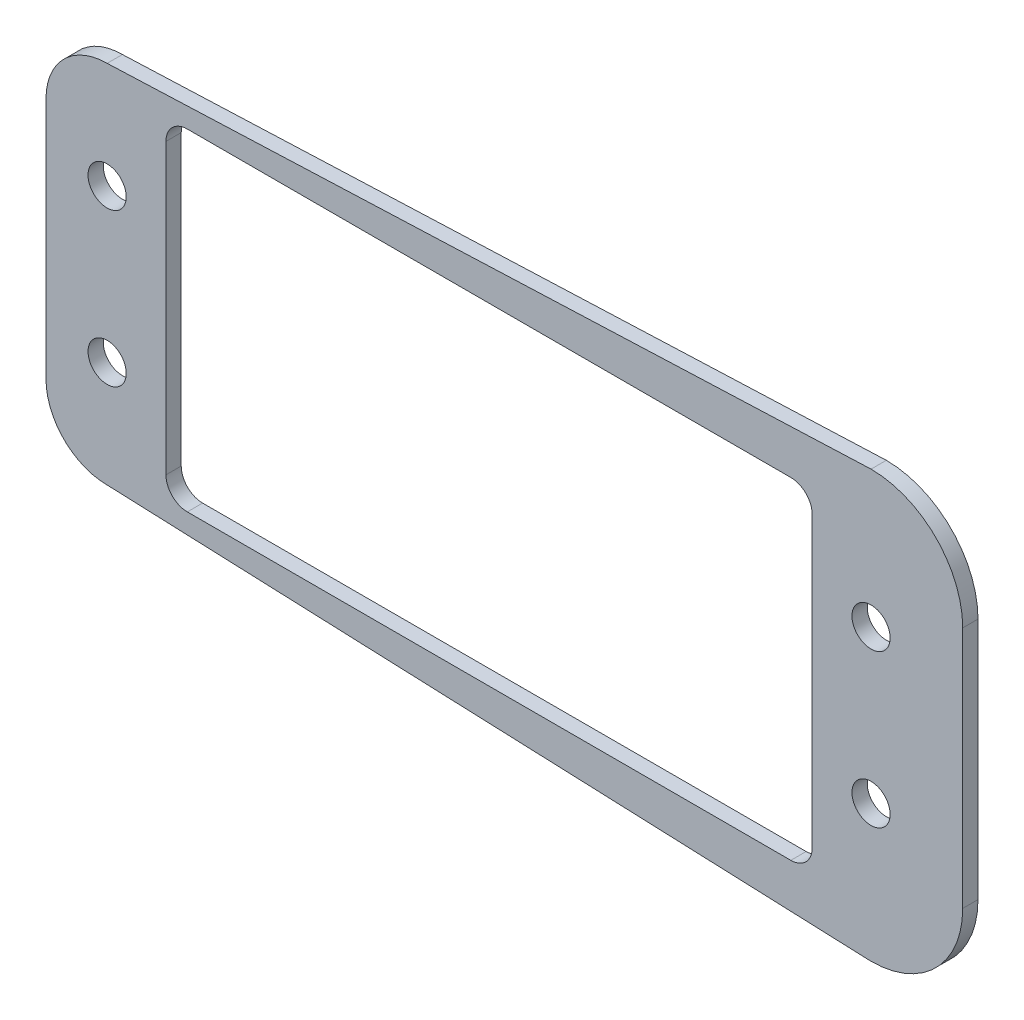
ISO-10303-21;
HEADER;
FILE_DESCRIPTION(('STEP AP214'),'2;1');
FILE_NAME('part.step','',(''),(''),'','','');
FILE_SCHEMA(('AUTOMOTIVE_DESIGN { 1 0 10303 214 1 1 1 1 }'));
ENDSEC;
DATA;
#1=APPLICATION_CONTEXT('core data for automotive mechanical design processes');
#2=APPLICATION_PROTOCOL_DEFINITION('international standard','automotive_design',2000,#1);
#3=PRODUCT_CONTEXT('',#1,'mechanical');
#4=PRODUCT('Part','Part','',(#3));
#5=PRODUCT_RELATED_PRODUCT_CATEGORY('part','',(#4));
#6=PRODUCT_DEFINITION_FORMATION('','',#4);
#7=PRODUCT_DEFINITION_CONTEXT('part definition',#1,'design');
#8=PRODUCT_DEFINITION('design','',#6,#7);
#9=PRODUCT_DEFINITION_SHAPE('','',#8);
#10=(LENGTH_UNIT() NAMED_UNIT(*) SI_UNIT(.MILLI.,.METRE.));
#11=(NAMED_UNIT(*) PLANE_ANGLE_UNIT() SI_UNIT($,.RADIAN.));
#12=(NAMED_UNIT(*) SI_UNIT($,.STERADIAN.) SOLID_ANGLE_UNIT());
#13=UNCERTAINTY_MEASURE_WITH_UNIT(LENGTH_MEASURE(1.E-05),#10,'distance_accuracy_value','');
#14=(GEOMETRIC_REPRESENTATION_CONTEXT(3) GLOBAL_UNCERTAINTY_ASSIGNED_CONTEXT((#13)) GLOBAL_UNIT_ASSIGNED_CONTEXT((#10,
#11,#12)) REPRESENTATION_CONTEXT('',''));
#15=CARTESIAN_POINT('',(0.,0.,0.));
#16=DIRECTION('',(0.,0.,1.));
#17=DIRECTION('',(1.,0.,0.));
#18=AXIS2_PLACEMENT_3D('',#15,#16,#17);
#19=CARTESIAN_POINT('',(34.9999999999878,-7.95000000000196,1.));
#20=DIRECTION('',(0.,0.,1.));
#21=DIRECTION('',(1.,0.,0.));
#22=AXIS2_PLACEMENT_3D('',#19,#20,#21);
#23=PLANE('',#22);
#24=CARTESIAN_POINT('',(-15.0000000000122,-5.00000000000197,1.));
#25=DIRECTION('',(0.,0.,1.));
#26=DIRECTION('',(1.,0.,0.));
#27=AXIS2_PLACEMENT_3D('',#24,#25,#26);
#28=CIRCLE('',#27,1.25);
#29=CARTESIAN_POINT('',(-13.7500000000122,-5.00000000000197,1.));
#30=VERTEX_POINT('',#29);
#31=EDGE_CURVE('E390',#30,#30,#28,.T.);
#32=ORIENTED_EDGE('',*,*,#31,.F.);
#33=EDGE_LOOP('',(#32));
#34=FACE_BOUND('',#33,.T.);
#35=CARTESIAN_POINT('',(34.9999999999878,-5.00000000000197,1.));
#36=DIRECTION('',(0.,0.,1.));
#37=DIRECTION('',(1.,0.,0.));
#38=AXIS2_PLACEMENT_3D('',#35,#36,#37);
#39=CIRCLE('',#38,1.25);
#40=CARTESIAN_POINT('',(36.2499999999878,-5.00000000000197,1.));
#41=VERTEX_POINT('',#40);
#42=EDGE_CURVE('E186',#41,#41,#39,.T.);
#43=ORIENTED_EDGE('',*,*,#42,.F.);
#44=EDGE_LOOP('',(#43));
#45=FACE_BOUND('',#44,.T.);
#46=CARTESIAN_POINT('',(34.9999999999878,-7.95000000000196,1.));
#47=DIRECTION('',(0.,0.,1.));
#48=DIRECTION('',(1.,0.,0.));
#49=AXIS2_PLACEMENT_3D('',#46,#47,#48);
#50=CIRCLE('',#49,6.);
#51=CARTESIAN_POINT('',(34.9999999999878,-13.950000000002,1.));
#52=VERTEX_POINT('',#51);
#53=CARTESIAN_POINT('',(40.9999999999878,-7.95000000000196,1.));
#54=VERTEX_POINT('',#53);
#55=EDGE_CURVE('E216',#52,#54,#50,.T.);
#56=ORIENTED_EDGE('',*,*,#55,.T.);
#57=DIRECTION('',(0.,1.,0.));
#58=VECTOR('',#57,1.);
#59=CARTESIAN_POINT('',(40.9999999999878,-7.95000000000196,1.));
#60=LINE('',#59,#58);
#61=CARTESIAN_POINT('',(40.9999999999878,7.94999999999804,1.));
#62=VERTEX_POINT('',#61);
#63=EDGE_CURVE('E219',#54,#62,#60,.T.);
#64=ORIENTED_EDGE('',*,*,#63,.T.);
#65=CARTESIAN_POINT('',(34.9999999999878,7.94999999999804,1.));
#66=DIRECTION('',(0.,0.,1.));
#67=DIRECTION('',(1.,0.,0.));
#68=AXIS2_PLACEMENT_3D('',#65,#66,#67);
#69=CIRCLE('',#68,6.);
#70=CARTESIAN_POINT('',(34.9999999999878,13.949999999998,1.));
#71=VERTEX_POINT('',#70);
#72=EDGE_CURVE('E222',#62,#71,#69,.T.);
#73=ORIENTED_EDGE('',*,*,#72,.T.);
#74=DIRECTION('',(-0.999200958721762,-0.039968038349556,0.));
#75=VECTOR('',#74,1.);
#76=CARTESIAN_POINT('',(34.9999999999878,13.949999999998,1.));
#77=LINE('',#76,#75);
#78=CARTESIAN_POINT('',(-15.0000000003011,11.9499999999522,1.));
#79=VERTEX_POINT('',#78);
#80=EDGE_CURVE('E224',#71,#79,#77,.T.);
#81=ORIENTED_EDGE('',*,*,#80,.T.);
#82=CARTESIAN_POINT('',(-15.0000000003011,7.94999999995218,1.));
#83=DIRECTION('',(0.,0.,1.));
#84=DIRECTION('',(1.,0.,0.));
#85=AXIS2_PLACEMENT_3D('',#82,#83,#84);
#86=CIRCLE('',#85,4.);
#87=CARTESIAN_POINT('',(-19.0000000003011,7.94999999995218,1.));
#88=VERTEX_POINT('',#87);
#89=EDGE_CURVE('E226',#79,#88,#86,.T.);
#90=ORIENTED_EDGE('',*,*,#89,.T.);
#91=DIRECTION('',(0.,-1.,0.));
#92=VECTOR('',#91,1.);
#93=CARTESIAN_POINT('',(-19.0000000003011,-7.95000000004782,1.));
#94=LINE('',#93,#92);
#95=CARTESIAN_POINT('',(-19.0000000003011,-7.95000000004782,1.));
#96=VERTEX_POINT('',#95);
#97=EDGE_CURVE('E228',#88,#96,#94,.T.);
#98=ORIENTED_EDGE('',*,*,#97,.T.);
#99=CARTESIAN_POINT('',(-15.0000000003011,-7.95000000004782,1.));
#100=DIRECTION('',(0.,0.,1.));
#101=DIRECTION('',(1.,0.,0.));
#102=AXIS2_PLACEMENT_3D('',#99,#100,#101);
#103=CIRCLE('',#102,4.);
#104=CARTESIAN_POINT('',(-15.0000000003011,-11.9500000000478,1.));
#105=VERTEX_POINT('',#104);
#106=EDGE_CURVE('E230',#96,#105,#103,.T.);
#107=ORIENTED_EDGE('',*,*,#106,.T.);
#108=DIRECTION('',(0.999200958721835,-0.0399680383477261,0.));
#109=VECTOR('',#108,1.);
#110=CARTESIAN_POINT('',(-15.0000000003011,-11.9500000000478,1.));
#111=LINE('',#110,#109);
#112=EDGE_CURVE('E232',#105,#52,#111,.T.);
#113=ORIENTED_EDGE('',*,*,#112,.T.);
#114=EDGE_LOOP('',(#56,#64,#73,#81,#90,#98,#107,#113));
#115=FACE_BOUND('',#114,.T.);
#116=DIRECTION('',(-1.,0.,0.));
#117=VECTOR('',#116,1.);
#118=CARTESIAN_POINT('',(29.7499999999878,10.849999999998,1.));
#119=LINE('',#118,#117);
#120=CARTESIAN_POINT('',(29.7499999999878,10.849999999998,1.));
#121=VERTEX_POINT('',#120);
#122=CARTESIAN_POINT('',(-9.75000000001225,10.849999999998,1.));
#123=VERTEX_POINT('',#122);
#124=EDGE_CURVE('E156',#121,#123,#119,.T.);
#125=ORIENTED_EDGE('',*,*,#124,.F.);
#126=CARTESIAN_POINT('',(29.7499999999878,9.44999999999803,1.));
#127=DIRECTION('',(0.,0.,1.));
#128=DIRECTION('',(1.,0.,0.));
#129=AXIS2_PLACEMENT_3D('',#126,#127,#128);
#130=CIRCLE('',#129,1.4);
#131=CARTESIAN_POINT('',(31.1499999999877,9.44999999999802,1.));
#132=VERTEX_POINT('',#131);
#133=EDGE_CURVE('E148',#132,#121,#130,.T.);
#134=ORIENTED_EDGE('',*,*,#133,.F.);
#135=DIRECTION('',(0.,1.,0.));
#136=VECTOR('',#135,1.);
#137=CARTESIAN_POINT('',(31.1499999999877,-9.45000000000197,1.));
#138=LINE('',#137,#136);
#139=CARTESIAN_POINT('',(31.1499999999877,-9.45000000000197,1.));
#140=VERTEX_POINT('',#139);
#141=EDGE_CURVE('E183',#140,#132,#138,.T.);
#142=ORIENTED_EDGE('',*,*,#141,.F.);
#143=CARTESIAN_POINT('',(29.7499999999878,-9.45000000000197,1.));
#144=DIRECTION('',(0.,0.,1.));
#145=DIRECTION('',(1.,0.,0.));
#146=AXIS2_PLACEMENT_3D('',#143,#144,#145);
#147=CIRCLE('',#146,1.4);
#148=CARTESIAN_POINT('',(29.7499999999878,-10.850000000002,1.));
#149=VERTEX_POINT('',#148);
#150=EDGE_CURVE('E181',#149,#140,#147,.T.);
#151=ORIENTED_EDGE('',*,*,#150,.F.);
#152=DIRECTION('',(1.,0.,0.));
#153=VECTOR('',#152,1.);
#154=CARTESIAN_POINT('',(-9.75000000001222,-10.850000000002,1.));
#155=LINE('',#154,#153);
#156=CARTESIAN_POINT('',(-9.75000000001222,-10.850000000002,1.));
#157=VERTEX_POINT('',#156);
#158=EDGE_CURVE('E179',#157,#149,#155,.T.);
#159=ORIENTED_EDGE('',*,*,#158,.F.);
#160=CARTESIAN_POINT('',(-9.75000000001225,-9.45000000000197,1.));
#161=DIRECTION('',(0.,0.,1.));
#162=DIRECTION('',(1.,0.,0.));
#163=AXIS2_PLACEMENT_3D('',#160,#161,#162);
#164=CIRCLE('',#163,1.4);
#165=CARTESIAN_POINT('',(-11.1500000000122,-9.45000000000197,1.));
#166=VERTEX_POINT('',#165);
#167=EDGE_CURVE('E177',#166,#157,#164,.T.);
#168=ORIENTED_EDGE('',*,*,#167,.F.);
#169=DIRECTION('',(0.,-1.,0.));
#170=VECTOR('',#169,1.);
#171=CARTESIAN_POINT('',(-11.1500000000122,9.44999999999803,1.));
#172=LINE('',#171,#170);
#173=CARTESIAN_POINT('',(-11.1500000000122,9.44999999999803,1.));
#174=VERTEX_POINT('',#173);
#175=EDGE_CURVE('E172',#174,#166,#172,.T.);
#176=ORIENTED_EDGE('',*,*,#175,.F.);
#177=CARTESIAN_POINT('',(-9.75000000001225,9.44999999999803,1.));
#178=DIRECTION('',(0.,0.,1.));
#179=DIRECTION('',(1.,0.,0.));
#180=AXIS2_PLACEMENT_3D('',#177,#178,#179);
#181=CIRCLE('',#180,1.4);
#182=EDGE_CURVE('E170',#123,#174,#181,.T.);
#183=ORIENTED_EDGE('',*,*,#182,.F.);
#184=EDGE_LOOP('',(#125,#134,#142,#151,#159,#168,#176,#183));
#185=FACE_BOUND('',#184,.T.);
#186=CARTESIAN_POINT('',(34.9999999999878,4.99999999999803,1.));
#187=DIRECTION('',(0.,0.,1.));
#188=DIRECTION('',(1.,0.,0.));
#189=AXIS2_PLACEMENT_3D('',#186,#187,#188);
#190=CIRCLE('',#189,1.25);
#191=CARTESIAN_POINT('',(36.2499999999878,4.99999999999803,1.));
#192=VERTEX_POINT('',#191);
#193=EDGE_CURVE('E396',#192,#192,#190,.T.);
#194=ORIENTED_EDGE('',*,*,#193,.F.);
#195=EDGE_LOOP('',(#194));
#196=FACE_BOUND('',#195,.T.);
#197=CARTESIAN_POINT('',(-15.0000000000122,4.99999999999803,1.));
#198=DIRECTION('',(0.,0.,1.));
#199=DIRECTION('',(1.,0.,0.));
#200=AXIS2_PLACEMENT_3D('',#197,#198,#199);
#201=CIRCLE('',#200,1.25);
#202=CARTESIAN_POINT('',(-13.7500000000122,4.99999999999803,1.));
#203=VERTEX_POINT('',#202);
#204=EDGE_CURVE('E381',#203,#203,#201,.T.);
#205=ORIENTED_EDGE('',*,*,#204,.F.);
#206=EDGE_LOOP('',(#205));
#207=FACE_BOUND('',#206,.T.);
#208=ADVANCED_FACE('F35',(#34,#45,#115,#185,#196,#207),#23,.T.);
#209=CARTESIAN_POINT('',(34.9999999999878,-7.95000000000196,0.));
#210=DIRECTION('',(0.,0.,1.));
#211=DIRECTION('',(1.,0.,0.));
#212=AXIS2_PLACEMENT_3D('',#209,#210,#211);
#213=PLANE('',#212);
#214=CARTESIAN_POINT('',(34.9999999999878,-7.95000000000196,0.));
#215=DIRECTION('',(0.,0.,1.));
#216=DIRECTION('',(1.,0.,0.));
#217=AXIS2_PLACEMENT_3D('',#214,#215,#216);
#218=CIRCLE('',#217,6.);
#219=CARTESIAN_POINT('',(34.9999999999878,-13.950000000002,0.));
#220=VERTEX_POINT('',#219);
#221=CARTESIAN_POINT('',(40.9999999999878,-7.95000000000196,0.));
#222=VERTEX_POINT('',#221);
#223=EDGE_CURVE('E164',#220,#222,#218,.T.);
#224=ORIENTED_EDGE('',*,*,#223,.F.);
#225=DIRECTION('',(0.999200958721835,-0.0399680383477261,0.));
#226=VECTOR('',#225,1.);
#227=CARTESIAN_POINT('',(-15.0000000003011,-11.9500000000478,0.));
#228=LINE('',#227,#226);
#229=CARTESIAN_POINT('',(-15.0000000003011,-11.9500000000478,0.));
#230=VERTEX_POINT('',#229);
#231=EDGE_CURVE('E220',#230,#220,#228,.T.);
#232=ORIENTED_EDGE('',*,*,#231,.F.);
#233=CARTESIAN_POINT('',(-15.0000000003011,-7.95000000004782,0.));
#234=DIRECTION('',(0.,0.,1.));
#235=DIRECTION('',(1.,0.,0.));
#236=AXIS2_PLACEMENT_3D('',#233,#234,#235);
#237=CIRCLE('',#236,4.);
#238=CARTESIAN_POINT('',(-19.0000000003011,-7.95000000004782,0.));
#239=VERTEX_POINT('',#238);
#240=EDGE_CURVE('E247',#239,#230,#237,.T.);
#241=ORIENTED_EDGE('',*,*,#240,.F.);
#242=DIRECTION('',(0.,-1.,0.));
#243=VECTOR('',#242,1.);
#244=CARTESIAN_POINT('',(-19.0000000003011,-7.95000000004782,0.));
#245=LINE('',#244,#243);
#246=CARTESIAN_POINT('',(-19.0000000003011,7.94999999995218,0.));
#247=VERTEX_POINT('',#246);
#248=EDGE_CURVE('E245',#247,#239,#245,.T.);
#249=ORIENTED_EDGE('',*,*,#248,.F.);
#250=CARTESIAN_POINT('',(-15.0000000003011,7.94999999995218,0.));
#251=DIRECTION('',(0.,0.,1.));
#252=DIRECTION('',(1.,0.,0.));
#253=AXIS2_PLACEMENT_3D('',#250,#251,#252);
#254=CIRCLE('',#253,4.);
#255=CARTESIAN_POINT('',(-15.0000000003011,11.9499999999522,0.));
#256=VERTEX_POINT('',#255);
#257=EDGE_CURVE('E243',#256,#247,#254,.T.);
#258=ORIENTED_EDGE('',*,*,#257,.F.);
#259=DIRECTION('',(-0.999200958721762,-0.039968038349556,0.));
#260=VECTOR('',#259,1.);
#261=CARTESIAN_POINT('',(34.9999999999878,13.949999999998,0.));
#262=LINE('',#261,#260);
#263=CARTESIAN_POINT('',(34.9999999999878,13.949999999998,0.));
#264=VERTEX_POINT('',#263);
#265=EDGE_CURVE('E241',#264,#256,#262,.T.);
#266=ORIENTED_EDGE('',*,*,#265,.F.);
#267=CARTESIAN_POINT('',(34.9999999999878,7.94999999999804,0.));
#268=DIRECTION('',(0.,0.,1.));
#269=DIRECTION('',(1.,0.,0.));
#270=AXIS2_PLACEMENT_3D('',#267,#268,#269);
#271=CIRCLE('',#270,6.);
#272=CARTESIAN_POINT('',(40.9999999999878,7.94999999999804,0.));
#273=VERTEX_POINT('',#272);
#274=EDGE_CURVE('E239',#273,#264,#271,.T.);
#275=ORIENTED_EDGE('',*,*,#274,.F.);
#276=DIRECTION('',(0.,1.,0.));
#277=VECTOR('',#276,1.);
#278=CARTESIAN_POINT('',(40.9999999999878,-7.95000000000196,0.));
#279=LINE('',#278,#277);
#280=EDGE_CURVE('E237',#222,#273,#279,.T.);
#281=ORIENTED_EDGE('',*,*,#280,.F.);
#282=EDGE_LOOP('',(#224,#232,#241,#249,#258,#266,#275,#281));
#283=FACE_BOUND('',#282,.T.);
#284=CARTESIAN_POINT('',(29.7499999999878,9.44999999999803,0.));
#285=DIRECTION('',(0.,0.,1.));
#286=DIRECTION('',(1.,0.,0.));
#287=AXIS2_PLACEMENT_3D('',#284,#285,#286);
#288=CIRCLE('',#287,1.4);
#289=CARTESIAN_POINT('',(31.1499999999877,9.44999999999802,0.));
#290=VERTEX_POINT('',#289);
#291=CARTESIAN_POINT('',(29.7499999999878,10.849999999998,0.));
#292=VERTEX_POINT('',#291);
#293=EDGE_CURVE('E58',#290,#292,#288,.T.);
#294=ORIENTED_EDGE('',*,*,#293,.T.);
#295=DIRECTION('',(-1.,0.,0.));
#296=VECTOR('',#295,1.);
#297=CARTESIAN_POINT('',(29.7499999999878,10.849999999998,0.));
#298=LINE('',#297,#296);
#299=CARTESIAN_POINT('',(-9.75000000001225,10.849999999998,0.));
#300=VERTEX_POINT('',#299);
#301=EDGE_CURVE('E163',#292,#300,#298,.T.);
#302=ORIENTED_EDGE('',*,*,#301,.T.);
#303=CARTESIAN_POINT('',(-9.75000000001225,9.44999999999803,0.));
#304=DIRECTION('',(0.,0.,1.));
#305=DIRECTION('',(1.,0.,0.));
#306=AXIS2_PLACEMENT_3D('',#303,#304,#305);
#307=CIRCLE('',#306,1.4);
#308=CARTESIAN_POINT('',(-11.1500000000122,9.44999999999803,0.));
#309=VERTEX_POINT('',#308);
#310=EDGE_CURVE('E188',#300,#309,#307,.T.);
#311=ORIENTED_EDGE('',*,*,#310,.T.);
#312=DIRECTION('',(0.,-1.,0.));
#313=VECTOR('',#312,1.);
#314=CARTESIAN_POINT('',(-11.1500000000122,9.44999999999803,0.));
#315=LINE('',#314,#313);
#316=CARTESIAN_POINT('',(-11.1500000000122,-9.45000000000197,0.));
#317=VERTEX_POINT('',#316);
#318=EDGE_CURVE('E191',#309,#317,#315,.T.);
#319=ORIENTED_EDGE('',*,*,#318,.T.);
#320=CARTESIAN_POINT('',(-9.75000000001225,-9.45000000000197,0.));
#321=DIRECTION('',(0.,0.,1.));
#322=DIRECTION('',(1.,0.,0.));
#323=AXIS2_PLACEMENT_3D('',#320,#321,#322);
#324=CIRCLE('',#323,1.4);
#325=CARTESIAN_POINT('',(-9.75000000001222,-10.850000000002,0.));
#326=VERTEX_POINT('',#325);
#327=EDGE_CURVE('E194',#317,#326,#324,.T.);
#328=ORIENTED_EDGE('',*,*,#327,.T.);
#329=DIRECTION('',(1.,0.,0.));
#330=VECTOR('',#329,1.);
#331=CARTESIAN_POINT('',(-9.75000000001222,-10.850000000002,0.));
#332=LINE('',#331,#330);
#333=CARTESIAN_POINT('',(29.7499999999878,-10.850000000002,0.));
#334=VERTEX_POINT('',#333);
#335=EDGE_CURVE('E197',#326,#334,#332,.T.);
#336=ORIENTED_EDGE('',*,*,#335,.T.);
#337=CARTESIAN_POINT('',(29.7499999999878,-9.45000000000197,0.));
#338=DIRECTION('',(0.,0.,1.));
#339=DIRECTION('',(1.,0.,0.));
#340=AXIS2_PLACEMENT_3D('',#337,#338,#339);
#341=CIRCLE('',#340,1.4);
#342=CARTESIAN_POINT('',(31.1499999999877,-9.45000000000197,0.));
#343=VERTEX_POINT('',#342);
#344=EDGE_CURVE('E200',#334,#343,#341,.T.);
#345=ORIENTED_EDGE('',*,*,#344,.T.);
#346=DIRECTION('',(0.,1.,0.));
#347=VECTOR('',#346,1.);
#348=CARTESIAN_POINT('',(31.1499999999877,-9.45000000000197,0.));
#349=LINE('',#348,#347);
#350=EDGE_CURVE('E157',#343,#290,#349,.T.);
#351=ORIENTED_EDGE('',*,*,#350,.T.);
#352=EDGE_LOOP('',(#294,#302,#311,#319,#328,#336,#345,#351));
#353=FACE_BOUND('',#352,.T.);
#354=CARTESIAN_POINT('',(34.9999999999878,-5.00000000000197,0.));
#355=DIRECTION('',(0.,0.,1.));
#356=DIRECTION('',(1.,0.,0.));
#357=AXIS2_PLACEMENT_3D('',#354,#355,#356);
#358=CIRCLE('',#357,1.25);
#359=CARTESIAN_POINT('',(36.2499999999878,-5.00000000000197,0.));
#360=VERTEX_POINT('',#359);
#361=EDGE_CURVE('E399',#360,#360,#358,.T.);
#362=ORIENTED_EDGE('',*,*,#361,.T.);
#363=EDGE_LOOP('',(#362));
#364=FACE_BOUND('',#363,.T.);
#365=CARTESIAN_POINT('',(34.9999999999878,4.99999999999803,0.));
#366=DIRECTION('',(0.,0.,1.));
#367=DIRECTION('',(1.,0.,0.));
#368=AXIS2_PLACEMENT_3D('',#365,#366,#367);
#369=CIRCLE('',#368,1.25);
#370=CARTESIAN_POINT('',(36.2499999999878,4.99999999999803,0.));
#371=VERTEX_POINT('',#370);
#372=EDGE_CURVE('E393',#371,#371,#369,.T.);
#373=ORIENTED_EDGE('',*,*,#372,.T.);
#374=EDGE_LOOP('',(#373));
#375=FACE_BOUND('',#374,.T.);
#376=CARTESIAN_POINT('',(-15.0000000000122,-5.00000000000197,0.));
#377=DIRECTION('',(0.,0.,1.));
#378=DIRECTION('',(1.,0.,0.));
#379=AXIS2_PLACEMENT_3D('',#376,#377,#378);
#380=CIRCLE('',#379,1.25);
#381=CARTESIAN_POINT('',(-13.7500000000122,-5.00000000000197,0.));
#382=VERTEX_POINT('',#381);
#383=EDGE_CURVE('E387',#382,#382,#380,.T.);
#384=ORIENTED_EDGE('',*,*,#383,.T.);
#385=EDGE_LOOP('',(#384));
#386=FACE_BOUND('',#385,.T.);
#387=CARTESIAN_POINT('',(-15.0000000000122,4.99999999999803,0.));
#388=DIRECTION('',(0.,0.,1.));
#389=DIRECTION('',(1.,0.,0.));
#390=AXIS2_PLACEMENT_3D('',#387,#388,#389);
#391=CIRCLE('',#390,1.25);
#392=CARTESIAN_POINT('',(-13.7500000000122,4.99999999999803,0.));
#393=VERTEX_POINT('',#392);
#394=EDGE_CURVE('E384',#393,#393,#391,.T.);
#395=ORIENTED_EDGE('',*,*,#394,.T.);
#396=EDGE_LOOP('',(#395));
#397=FACE_BOUND('',#396,.T.);
#398=ADVANCED_FACE('F277',(#283,#353,#364,#375,#386,#397),#213,.F.);
#399=CARTESIAN_POINT('',(34.9999999999878,-7.95000000000196,1.));
#400=DIRECTION('',(0.,0.,-1.));
#401=DIRECTION('',(-1.,0.,0.));
#402=AXIS2_PLACEMENT_3D('',#399,#400,#401);
#403=CYLINDRICAL_SURFACE('',#402,6.);
#404=ORIENTED_EDGE('',*,*,#223,.T.);
#405=DIRECTION('',(0.,0.,-1.));
#406=VECTOR('',#405,1.);
#407=CARTESIAN_POINT('',(40.9999999999878,-7.95000000000196,1.));
#408=LINE('',#407,#406);
#409=EDGE_CURVE('E11',#54,#222,#408,.T.);
#410=ORIENTED_EDGE('',*,*,#409,.F.);
#411=ORIENTED_EDGE('',*,*,#55,.F.);
#412=DIRECTION('',(0.,0.,-1.));
#413=VECTOR('',#412,1.);
#414=CARTESIAN_POINT('',(34.9999999999878,-13.950000000002,1.));
#415=LINE('',#414,#413);
#416=EDGE_CURVE('E234',#52,#220,#415,.T.);
#417=ORIENTED_EDGE('',*,*,#416,.T.);
#418=EDGE_LOOP('',(#404,#410,#411,#417));
#419=FACE_BOUND('',#418,.T.);
#420=ADVANCED_FACE('F37',(#419),#403,.T.);
#421=CARTESIAN_POINT('',(40.9999999999878,-7.95000000000196,1.));
#422=DIRECTION('',(-1.,0.,0.));
#423=DIRECTION('',(0.,-1.,0.));
#424=AXIS2_PLACEMENT_3D('',#421,#422,#423);
#425=PLANE('',#424);
#426=ORIENTED_EDGE('',*,*,#280,.T.);
#427=DIRECTION('',(0.,0.,-1.));
#428=VECTOR('',#427,1.);
#429=CARTESIAN_POINT('',(40.9999999999878,7.94999999999804,1.));
#430=LINE('',#429,#428);
#431=EDGE_CURVE('E43',#62,#273,#430,.T.);
#432=ORIENTED_EDGE('',*,*,#431,.F.);
#433=ORIENTED_EDGE('',*,*,#63,.F.);
#434=ORIENTED_EDGE('',*,*,#409,.T.);
#435=EDGE_LOOP('',(#426,#432,#433,#434));
#436=FACE_BOUND('',#435,.T.);
#437=ADVANCED_FACE('F294',(#436),#425,.F.);
#438=CARTESIAN_POINT('',(34.9999999999878,7.94999999999804,1.));
#439=DIRECTION('',(0.,0.,-1.));
#440=DIRECTION('',(-1.,0.,0.));
#441=AXIS2_PLACEMENT_3D('',#438,#439,#440);
#442=CYLINDRICAL_SURFACE('',#441,6.);
#443=ORIENTED_EDGE('',*,*,#274,.T.);
#444=DIRECTION('',(0.,0.,-1.));
#445=VECTOR('',#444,1.);
#446=CARTESIAN_POINT('',(34.9999999999878,13.949999999998,1.));
#447=LINE('',#446,#445);
#448=EDGE_CURVE('E264',#71,#264,#447,.T.);
#449=ORIENTED_EDGE('',*,*,#448,.F.);
#450=ORIENTED_EDGE('',*,*,#72,.F.);
#451=ORIENTED_EDGE('',*,*,#431,.T.);
#452=EDGE_LOOP('',(#443,#449,#450,#451));
#453=FACE_BOUND('',#452,.T.);
#454=ADVANCED_FACE('F271',(#453),#442,.T.);
#455=CARTESIAN_POINT('',(34.9999999999878,13.949999999998,1.));
#456=DIRECTION('',(0.039968038349556,-0.999200958721762,0.));
#457=DIRECTION('',(0.999200958721762,0.039968038349556,0.));
#458=AXIS2_PLACEMENT_3D('',#455,#456,#457);
#459=PLANE('',#458);
#460=ORIENTED_EDGE('',*,*,#265,.T.);
#461=DIRECTION('',(0.,0.,-1.));
#462=VECTOR('',#461,1.);
#463=CARTESIAN_POINT('',(-15.0000000003011,11.9499999999522,1.));
#464=LINE('',#463,#462);
#465=EDGE_CURVE('E261',#79,#256,#464,.T.);
#466=ORIENTED_EDGE('',*,*,#465,.F.);
#467=ORIENTED_EDGE('',*,*,#80,.F.);
#468=ORIENTED_EDGE('',*,*,#448,.T.);
#469=EDGE_LOOP('',(#460,#466,#467,#468));
#470=FACE_BOUND('',#469,.T.);
#471=ADVANCED_FACE('F283',(#470),#459,.F.);
#472=CARTESIAN_POINT('',(-15.0000000003011,7.94999999995218,1.));
#473=DIRECTION('',(0.,0.,-1.));
#474=DIRECTION('',(-1.,0.,0.));
#475=AXIS2_PLACEMENT_3D('',#472,#473,#474);
#476=CYLINDRICAL_SURFACE('',#475,4.);
#477=ORIENTED_EDGE('',*,*,#257,.T.);
#478=DIRECTION('',(0.,0.,-1.));
#479=VECTOR('',#478,1.);
#480=CARTESIAN_POINT('',(-19.0000000003011,7.94999999995218,1.));
#481=LINE('',#480,#479);
#482=EDGE_CURVE('E258',#88,#247,#481,.T.);
#483=ORIENTED_EDGE('',*,*,#482,.F.);
#484=ORIENTED_EDGE('',*,*,#89,.F.);
#485=ORIENTED_EDGE('',*,*,#465,.T.);
#486=EDGE_LOOP('',(#477,#483,#484,#485));
#487=FACE_BOUND('',#486,.T.);
#488=ADVANCED_FACE('F287',(#487),#476,.T.);
#489=CARTESIAN_POINT('',(-19.0000000003011,-7.95000000004782,1.));
#490=DIRECTION('',(1.,0.,0.));
#491=DIRECTION('',(0.,0.,-1.));
#492=AXIS2_PLACEMENT_3D('',#489,#490,#491);
#493=PLANE('',#492);
#494=ORIENTED_EDGE('',*,*,#248,.T.);
#495=DIRECTION('',(0.,0.,-1.));
#496=VECTOR('',#495,1.);
#497=CARTESIAN_POINT('',(-19.0000000003011,-7.95000000004782,1.));
#498=LINE('',#497,#496);
#499=EDGE_CURVE('E255',#96,#239,#498,.T.);
#500=ORIENTED_EDGE('',*,*,#499,.F.);
#501=ORIENTED_EDGE('',*,*,#97,.F.);
#502=ORIENTED_EDGE('',*,*,#482,.T.);
#503=EDGE_LOOP('',(#494,#500,#501,#502));
#504=FACE_BOUND('',#503,.T.);
#505=ADVANCED_FACE('F307',(#504),#493,.F.);
#506=CARTESIAN_POINT('',(-15.0000000003011,-7.95000000004782,1.));
#507=DIRECTION('',(0.,0.,-1.));
#508=DIRECTION('',(-1.,0.,0.));
#509=AXIS2_PLACEMENT_3D('',#506,#507,#508);
#510=CYLINDRICAL_SURFACE('',#509,4.);
#511=ORIENTED_EDGE('',*,*,#240,.T.);
#512=DIRECTION('',(0.,0.,-1.));
#513=VECTOR('',#512,1.);
#514=CARTESIAN_POINT('',(-15.0000000003011,-11.9500000000478,1.));
#515=LINE('',#514,#513);
#516=EDGE_CURVE('E252',#105,#230,#515,.T.);
#517=ORIENTED_EDGE('',*,*,#516,.F.);
#518=ORIENTED_EDGE('',*,*,#106,.F.);
#519=ORIENTED_EDGE('',*,*,#499,.T.);
#520=EDGE_LOOP('',(#511,#517,#518,#519));
#521=FACE_BOUND('',#520,.T.);
#522=ADVANCED_FACE('F305',(#521),#510,.T.);
#523=CARTESIAN_POINT('',(-15.0000000003011,-11.9500000000478,1.));
#524=DIRECTION('',(0.0399680383477261,0.999200958721835,0.));
#525=DIRECTION('',(-0.999200958721835,0.0399680383477261,0.));
#526=AXIS2_PLACEMENT_3D('',#523,#524,#525);
#527=PLANE('',#526);
#528=ORIENTED_EDGE('',*,*,#231,.T.);
#529=ORIENTED_EDGE('',*,*,#416,.F.);
#530=ORIENTED_EDGE('',*,*,#112,.F.);
#531=ORIENTED_EDGE('',*,*,#516,.T.);
#532=EDGE_LOOP('',(#528,#529,#530,#531));
#533=FACE_BOUND('',#532,.T.);
#534=ADVANCED_FACE('F300',(#533),#527,.F.);
#535=CARTESIAN_POINT('',(29.7499999999878,9.44999999999803,1.));
#536=DIRECTION('',(0.,0.,-1.));
#537=DIRECTION('',(-1.,0.,0.));
#538=AXIS2_PLACEMENT_3D('',#535,#536,#537);
#539=CYLINDRICAL_SURFACE('',#538,1.4);
#540=ORIENTED_EDGE('',*,*,#293,.F.);
#541=DIRECTION('',(0.,0.,-1.));
#542=VECTOR('',#541,1.);
#543=CARTESIAN_POINT('',(31.1499999999877,9.44999999999802,1.));
#544=LINE('',#543,#542);
#545=EDGE_CURVE('E152',#132,#290,#544,.T.);
#546=ORIENTED_EDGE('',*,*,#545,.F.);
#547=ORIENTED_EDGE('',*,*,#133,.T.);
#548=DIRECTION('',(0.,0.,-1.));
#549=VECTOR('',#548,1.);
#550=CARTESIAN_POINT('',(29.7499999999878,10.849999999998,1.));
#551=LINE('',#550,#549);
#552=EDGE_CURVE('E151',#121,#292,#551,.T.);
#553=ORIENTED_EDGE('',*,*,#552,.T.);
#554=EDGE_LOOP('',(#540,#546,#547,#553));
#555=FACE_BOUND('',#554,.T.);
#556=ADVANCED_FACE('F150',(#555),#539,.F.);
#557=CARTESIAN_POINT('',(29.7499999999878,10.849999999998,1.));
#558=DIRECTION('',(0.,-1.,0.));
#559=DIRECTION('',(1.,0.,0.));
#560=AXIS2_PLACEMENT_3D('',#557,#558,#559);
#561=PLANE('',#560);
#562=ORIENTED_EDGE('',*,*,#301,.F.);
#563=ORIENTED_EDGE('',*,*,#552,.F.);
#564=ORIENTED_EDGE('',*,*,#124,.T.);
#565=DIRECTION('',(0.,0.,-1.));
#566=VECTOR('',#565,1.);
#567=CARTESIAN_POINT('',(-9.75000000001225,10.849999999998,1.));
#568=LINE('',#567,#566);
#569=EDGE_CURVE('E165',#123,#300,#568,.T.);
#570=ORIENTED_EDGE('',*,*,#569,.T.);
#571=EDGE_LOOP('',(#562,#563,#564,#570));
#572=FACE_BOUND('',#571,.T.);
#573=ADVANCED_FACE('F160',(#572),#561,.T.);
#574=CARTESIAN_POINT('',(-9.75000000001225,9.44999999999803,1.));
#575=DIRECTION('',(0.,0.,-1.));
#576=DIRECTION('',(-1.,0.,0.));
#577=AXIS2_PLACEMENT_3D('',#574,#575,#576);
#578=CYLINDRICAL_SURFACE('',#577,1.4);
#579=ORIENTED_EDGE('',*,*,#310,.F.);
#580=ORIENTED_EDGE('',*,*,#569,.F.);
#581=ORIENTED_EDGE('',*,*,#182,.T.);
#582=DIRECTION('',(0.,0.,-1.));
#583=VECTOR('',#582,1.);
#584=CARTESIAN_POINT('',(-11.1500000000122,9.44999999999803,1.));
#585=LINE('',#584,#583);
#586=EDGE_CURVE('E213',#174,#309,#585,.T.);
#587=ORIENTED_EDGE('',*,*,#586,.T.);
#588=EDGE_LOOP('',(#579,#580,#581,#587));
#589=FACE_BOUND('',#588,.T.);
#590=ADVANCED_FACE('F335',(#589),#578,.F.);
#591=CARTESIAN_POINT('',(-11.1500000000122,9.44999999999803,1.));
#592=DIRECTION('',(1.,0.,0.));
#593=DIRECTION('',(0.,1.,0.));
#594=AXIS2_PLACEMENT_3D('',#591,#592,#593);
#595=PLANE('',#594);
#596=ORIENTED_EDGE('',*,*,#318,.F.);
#597=ORIENTED_EDGE('',*,*,#586,.F.);
#598=ORIENTED_EDGE('',*,*,#175,.T.);
#599=DIRECTION('',(0.,0.,-1.));
#600=VECTOR('',#599,1.);
#601=CARTESIAN_POINT('',(-11.1500000000122,-9.45000000000197,1.));
#602=LINE('',#601,#600);
#603=EDGE_CURVE('E211',#166,#317,#602,.T.);
#604=ORIENTED_EDGE('',*,*,#603,.T.);
#605=EDGE_LOOP('',(#596,#597,#598,#604));
#606=FACE_BOUND('',#605,.T.);
#607=ADVANCED_FACE('F339',(#606),#595,.T.);
#608=CARTESIAN_POINT('',(-9.75000000001225,-9.45000000000197,1.));
#609=DIRECTION('',(0.,0.,-1.));
#610=DIRECTION('',(-1.,0.,0.));
#611=AXIS2_PLACEMENT_3D('',#608,#609,#610);
#612=CYLINDRICAL_SURFACE('',#611,1.4);
#613=ORIENTED_EDGE('',*,*,#327,.F.);
#614=ORIENTED_EDGE('',*,*,#603,.F.);
#615=ORIENTED_EDGE('',*,*,#167,.T.);
#616=DIRECTION('',(0.,0.,-1.));
#617=VECTOR('',#616,1.);
#618=CARTESIAN_POINT('',(-9.75000000001222,-10.850000000002,1.));
#619=LINE('',#618,#617);
#620=EDGE_CURVE('E209',#157,#326,#619,.T.);
#621=ORIENTED_EDGE('',*,*,#620,.T.);
#622=EDGE_LOOP('',(#613,#614,#615,#621));
#623=FACE_BOUND('',#622,.T.);
#624=ADVANCED_FACE('F345',(#623),#612,.F.);
#625=CARTESIAN_POINT('',(-9.75000000001222,-10.850000000002,1.));
#626=DIRECTION('',(0.,1.,0.));
#627=DIRECTION('',(-1.,0.,0.));
#628=AXIS2_PLACEMENT_3D('',#625,#626,#627);
#629=PLANE('',#628);
#630=ORIENTED_EDGE('',*,*,#335,.F.);
#631=ORIENTED_EDGE('',*,*,#620,.F.);
#632=ORIENTED_EDGE('',*,*,#158,.T.);
#633=DIRECTION('',(0.,0.,-1.));
#634=VECTOR('',#633,1.);
#635=CARTESIAN_POINT('',(29.7499999999878,-10.850000000002,1.));
#636=LINE('',#635,#634);
#637=EDGE_CURVE('E207',#149,#334,#636,.T.);
#638=ORIENTED_EDGE('',*,*,#637,.T.);
#639=EDGE_LOOP('',(#630,#631,#632,#638));
#640=FACE_BOUND('',#639,.T.);
#641=ADVANCED_FACE('F349',(#640),#629,.T.);
#642=CARTESIAN_POINT('',(29.7499999999878,-9.45000000000197,1.));
#643=DIRECTION('',(0.,0.,-1.));
#644=DIRECTION('',(-1.,0.,0.));
#645=AXIS2_PLACEMENT_3D('',#642,#643,#644);
#646=CYLINDRICAL_SURFACE('',#645,1.4);
#647=ORIENTED_EDGE('',*,*,#344,.F.);
#648=ORIENTED_EDGE('',*,*,#637,.F.);
#649=ORIENTED_EDGE('',*,*,#150,.T.);
#650=DIRECTION('',(0.,0.,-1.));
#651=VECTOR('',#650,1.);
#652=CARTESIAN_POINT('',(31.1499999999877,-9.45000000000197,1.));
#653=LINE('',#652,#651);
#654=EDGE_CURVE('E50',#140,#343,#653,.T.);
#655=ORIENTED_EDGE('',*,*,#654,.T.);
#656=EDGE_LOOP('',(#647,#648,#649,#655));
#657=FACE_BOUND('',#656,.T.);
#658=ADVANCED_FACE('F353',(#657),#646,.F.);
#659=CARTESIAN_POINT('',(31.1499999999877,-9.45000000000197,1.));
#660=DIRECTION('',(-1.,0.,0.));
#661=DIRECTION('',(0.,0.,1.));
#662=AXIS2_PLACEMENT_3D('',#659,#660,#661);
#663=PLANE('',#662);
#664=ORIENTED_EDGE('',*,*,#350,.F.);
#665=ORIENTED_EDGE('',*,*,#654,.F.);
#666=ORIENTED_EDGE('',*,*,#141,.T.);
#667=ORIENTED_EDGE('',*,*,#545,.T.);
#668=EDGE_LOOP('',(#664,#665,#666,#667));
#669=FACE_BOUND('',#668,.T.);
#670=ADVANCED_FACE('F357',(#669),#663,.T.);
#671=CARTESIAN_POINT('',(34.9999999999878,-5.00000000000197,1.));
#672=DIRECTION('',(0.,0.,-1.));
#673=DIRECTION('',(-1.,0.,0.));
#674=AXIS2_PLACEMENT_3D('',#671,#672,#673);
#675=CYLINDRICAL_SURFACE('',#674,1.25);
#676=ORIENTED_EDGE('',*,*,#42,.T.);
#677=EDGE_LOOP('',(#676));
#678=FACE_BOUND('',#677,.T.);
#679=ORIENTED_EDGE('',*,*,#361,.F.);
#680=EDGE_LOOP('',(#679));
#681=FACE_BOUND('',#680,.T.);
#682=ADVANCED_FACE('F361',(#678,#681),#675,.F.);
#683=CARTESIAN_POINT('',(34.9999999999878,4.99999999999803,1.));
#684=DIRECTION('',(0.,0.,-1.));
#685=DIRECTION('',(-1.,0.,0.));
#686=AXIS2_PLACEMENT_3D('',#683,#684,#685);
#687=CYLINDRICAL_SURFACE('',#686,1.25);
#688=ORIENTED_EDGE('',*,*,#193,.T.);
#689=EDGE_LOOP('',(#688));
#690=FACE_BOUND('',#689,.T.);
#691=ORIENTED_EDGE('',*,*,#372,.F.);
#692=EDGE_LOOP('',(#691));
#693=FACE_BOUND('',#692,.T.);
#694=ADVANCED_FACE('F364',(#690,#693),#687,.F.);
#695=CARTESIAN_POINT('',(-15.0000000000122,-5.00000000000197,1.));
#696=DIRECTION('',(0.,0.,-1.));
#697=DIRECTION('',(-1.,0.,0.));
#698=AXIS2_PLACEMENT_3D('',#695,#696,#697);
#699=CYLINDRICAL_SURFACE('',#698,1.25);
#700=ORIENTED_EDGE('',*,*,#31,.T.);
#701=EDGE_LOOP('',(#700));
#702=FACE_BOUND('',#701,.T.);
#703=ORIENTED_EDGE('',*,*,#383,.F.);
#704=EDGE_LOOP('',(#703));
#705=FACE_BOUND('',#704,.T.);
#706=ADVANCED_FACE('F368',(#702,#705),#699,.F.);
#707=CARTESIAN_POINT('',(-15.0000000000122,4.99999999999803,1.));
#708=DIRECTION('',(0.,0.,-1.));
#709=DIRECTION('',(-1.,0.,0.));
#710=AXIS2_PLACEMENT_3D('',#707,#708,#709);
#711=CYLINDRICAL_SURFACE('',#710,1.25);
#712=ORIENTED_EDGE('',*,*,#204,.T.);
#713=EDGE_LOOP('',(#712));
#714=FACE_BOUND('',#713,.T.);
#715=ORIENTED_EDGE('',*,*,#394,.F.);
#716=EDGE_LOOP('',(#715));
#717=FACE_BOUND('',#716,.T.);
#718=ADVANCED_FACE('F372',(#714,#717),#711,.F.);
#719=CLOSED_SHELL('',(#208,#398,#420,#437,#454,#471,#488,#505,#522,#534,#556,#573,#590,#607,
#624,#641,#658,#670,#682,#694,#706,#718));
#720=MANIFOLD_SOLID_BREP('B2',#719);
#721=ADVANCED_BREP_SHAPE_REPRESENTATION('',(#18,#720),#14);
#722=SHAPE_DEFINITION_REPRESENTATION(#9,#721);
ENDSEC;
END-ISO-10303-21;
